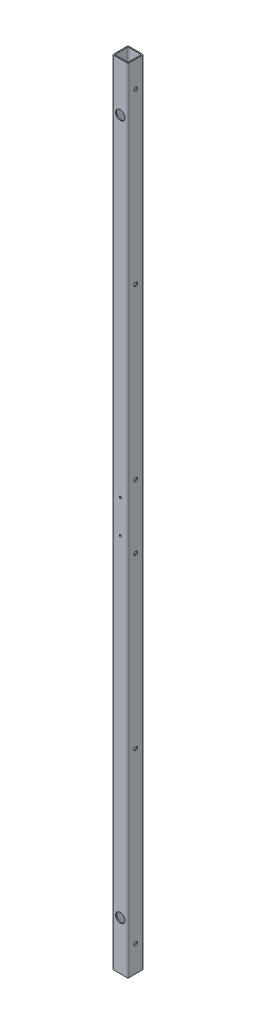
ISO-10303-21;
HEADER;
FILE_DESCRIPTION(('STEP AP214'),'2;1');
FILE_NAME('part.step','',(''),(''),'','','');
FILE_SCHEMA(('AUTOMOTIVE_DESIGN { 1 0 10303 214 1 1 1 1 }'));
ENDSEC;
DATA;
#1=APPLICATION_CONTEXT('core data for automotive mechanical design processes');
#2=APPLICATION_PROTOCOL_DEFINITION('international standard','automotive_design',2000,#1);
#3=PRODUCT_CONTEXT('',#1,'mechanical');
#4=PRODUCT('Part','Part','',(#3));
#5=PRODUCT_RELATED_PRODUCT_CATEGORY('part','',(#4));
#6=PRODUCT_DEFINITION_FORMATION('','',#4);
#7=PRODUCT_DEFINITION_CONTEXT('part definition',#1,'design');
#8=PRODUCT_DEFINITION('design','',#6,#7);
#9=PRODUCT_DEFINITION_SHAPE('','',#8);
#10=(LENGTH_UNIT() NAMED_UNIT(*) SI_UNIT(.MILLI.,.METRE.));
#11=(NAMED_UNIT(*) PLANE_ANGLE_UNIT() SI_UNIT($,.RADIAN.));
#12=(NAMED_UNIT(*) SI_UNIT($,.STERADIAN.) SOLID_ANGLE_UNIT());
#13=UNCERTAINTY_MEASURE_WITH_UNIT(LENGTH_MEASURE(1.E-05),#10,'distance_accuracy_value','');
#14=(GEOMETRIC_REPRESENTATION_CONTEXT(3) GLOBAL_UNCERTAINTY_ASSIGNED_CONTEXT((#13)) GLOBAL_UNIT_ASSIGNED_CONTEXT((#10,
#11,#12)) REPRESENTATION_CONTEXT('',''));
#15=CARTESIAN_POINT('',(0.,0.,0.));
#16=DIRECTION('',(0.,0.,1.));
#17=DIRECTION('',(1.,0.,0.));
#18=AXIS2_PLACEMENT_3D('',#15,#16,#17);
#19=CARTESIAN_POINT('',(-12.7,1309.624,-12.7));
#20=DIRECTION('',(0.,0.,1.));
#21=DIRECTION('',(1.,0.,0.));
#22=AXIS2_PLACEMENT_3D('',#19,#20,#21);
#23=PLANE('',#22);
#24=CARTESIAN_POINT('',(0.,1229.36,-12.7));
#25=DIRECTION('',(0.,0.,1.));
#26=DIRECTION('',(1.,0.,0.));
#27=AXIS2_PLACEMENT_3D('',#24,#25,#26);
#28=CIRCLE('',#27,7.739126);
#29=CARTESIAN_POINT('',(7.739126,1229.36,-12.7));
#30=VERTEX_POINT('',#29);
#31=EDGE_CURVE('E813',#30,#30,#28,.T.);
#32=ORIENTED_EDGE('',*,*,#31,.T.);
#33=EDGE_LOOP('',(#32));
#34=FACE_BOUND('',#33,.T.);
#35=CARTESIAN_POINT('',(0.,80.264,-12.7));
#36=DIRECTION('',(0.,0.,1.));
#37=DIRECTION('',(1.,0.,0.));
#38=AXIS2_PLACEMENT_3D('',#35,#36,#37);
#39=CIRCLE('',#38,7.739126);
#40=CARTESIAN_POINT('',(7.739126,80.264,-12.7));
#41=VERTEX_POINT('',#40);
#42=EDGE_CURVE('E279',#41,#41,#39,.T.);
#43=ORIENTED_EDGE('',*,*,#42,.T.);
#44=EDGE_LOOP('',(#43));
#45=FACE_BOUND('',#44,.T.);
#46=CARTESIAN_POINT('',(0.,627.38,-12.7));
#47=DIRECTION('',(0.,0.,-1.));
#48=DIRECTION('',(-1.,0.,0.));
#49=AXIS2_PLACEMENT_3D('',#46,#47,#48);
#50=CIRCLE('',#49,1.72719999999999);
#51=CARTESIAN_POINT('',(-1.72719999999999,627.38,-12.7));
#52=VERTEX_POINT('',#51);
#53=EDGE_CURVE('E306',#52,#52,#50,.T.);
#54=ORIENTED_EDGE('',*,*,#53,.F.);
#55=EDGE_LOOP('',(#54));
#56=FACE_BOUND('',#55,.T.);
#57=DIRECTION('',(-1.,0.,0.));
#58=VECTOR('',#57,1.);
#59=CARTESIAN_POINT('',(-12.7,0.,-12.7));
#60=LINE('',#59,#58);
#61=CARTESIAN_POINT('',(11.43,0.,-12.7));
#62=VERTEX_POINT('',#61);
#63=CARTESIAN_POINT('',(-11.43,0.,-12.7));
#64=VERTEX_POINT('',#63);
#65=EDGE_CURVE('E381',#62,#64,#60,.T.);
#66=ORIENTED_EDGE('',*,*,#65,.T.);
#67=DIRECTION('',(0.,-1.,0.));
#68=VECTOR('',#67,1.);
#69=CARTESIAN_POINT('',(-11.43,1309.624,-12.7));
#70=LINE('',#69,#68);
#71=CARTESIAN_POINT('',(-11.43,1309.624,-12.7));
#72=VERTEX_POINT('',#71);
#73=EDGE_CURVE('E51',#64,#72,#70,.F.);
#74=ORIENTED_EDGE('',*,*,#73,.T.);
#75=DIRECTION('',(-1.,0.,0.));
#76=VECTOR('',#75,1.);
#77=CARTESIAN_POINT('',(-12.7,1309.624,-12.7));
#78=LINE('',#77,#76);
#79=CARTESIAN_POINT('',(11.43,1309.624,-12.7));
#80=VERTEX_POINT('',#79);
#81=EDGE_CURVE('E375',#80,#72,#78,.T.);
#82=ORIENTED_EDGE('',*,*,#81,.F.);
#83=DIRECTION('',(0.,-1.,0.));
#84=VECTOR('',#83,1.);
#85=CARTESIAN_POINT('',(11.43,1309.624,-12.7));
#86=LINE('',#85,#84);
#87=EDGE_CURVE('E224',#80,#62,#86,.T.);
#88=ORIENTED_EDGE('',*,*,#87,.T.);
#89=EDGE_LOOP('',(#66,#74,#82,#88));
#90=FACE_BOUND('',#89,.T.);
#91=CARTESIAN_POINT('',(0.,682.244,-12.7));
#92=DIRECTION('',(0.,0.,-1.));
#93=DIRECTION('',(-1.,0.,0.));
#94=AXIS2_PLACEMENT_3D('',#91,#92,#93);
#95=CIRCLE('',#94,1.72719999999999);
#96=CARTESIAN_POINT('',(-1.72719999999999,682.244,-12.7));
#97=VERTEX_POINT('',#96);
#98=EDGE_CURVE('E283',#97,#97,#95,.T.);
#99=ORIENTED_EDGE('',*,*,#98,.F.);
#100=EDGE_LOOP('',(#99));
#101=FACE_BOUND('',#100,.T.);
#102=ADVANCED_FACE('F34',(#34,#45,#56,#90,#101),#23,.F.);
#103=CARTESIAN_POINT('',(0.,1309.624,0.));
#104=DIRECTION('',(0.,-1.,0.));
#105=DIRECTION('',(0.,0.,-1.));
#106=AXIS2_PLACEMENT_3D('',#103,#104,#105);
#107=PLANE('',#106);
#108=DIRECTION('',(0.,0.,1.));
#109=VECTOR('',#108,1.);
#110=CARTESIAN_POINT('',(-12.7,1309.624,12.7));
#111=LINE('',#110,#109);
#112=CARTESIAN_POINT('',(-12.7,1309.624,-11.43));
#113=VERTEX_POINT('',#112);
#114=CARTESIAN_POINT('',(-12.7,1309.624,11.43));
#115=VERTEX_POINT('',#114);
#116=EDGE_CURVE('E180',#113,#115,#111,.T.);
#117=ORIENTED_EDGE('',*,*,#116,.T.);
#118=CARTESIAN_POINT('',(-11.43,1309.624,11.43));
#119=DIRECTION('',(0.,-1.,0.));
#120=DIRECTION('',(0.,0.,-1.));
#121=AXIS2_PLACEMENT_3D('',#118,#119,#120);
#122=CIRCLE('',#121,1.27);
#123=CARTESIAN_POINT('',(-11.43,1309.624,12.7));
#124=VERTEX_POINT('',#123);
#125=EDGE_CURVE('E222',#115,#124,#122,.F.);
#126=ORIENTED_EDGE('',*,*,#125,.T.);
#127=DIRECTION('',(1.,0.,0.));
#128=VECTOR('',#127,1.);
#129=CARTESIAN_POINT('',(-12.7,1309.624,12.7));
#130=LINE('',#129,#128);
#131=CARTESIAN_POINT('',(11.43,1309.624,12.7));
#132=VERTEX_POINT('',#131);
#133=EDGE_CURVE('E175',#124,#132,#130,.T.);
#134=ORIENTED_EDGE('',*,*,#133,.T.);
#135=CARTESIAN_POINT('',(11.43,1309.624,11.43));
#136=DIRECTION('',(0.,-1.,0.));
#137=DIRECTION('',(0.,0.,-1.));
#138=AXIS2_PLACEMENT_3D('',#135,#136,#137);
#139=CIRCLE('',#138,1.27);
#140=CARTESIAN_POINT('',(12.7,1309.624,11.43));
#141=VERTEX_POINT('',#140);
#142=EDGE_CURVE('E217',#132,#141,#139,.F.);
#143=ORIENTED_EDGE('',*,*,#142,.T.);
#144=DIRECTION('',(0.,0.,-1.));
#145=VECTOR('',#144,1.);
#146=CARTESIAN_POINT('',(12.7,1309.624,12.7));
#147=LINE('',#146,#145);
#148=CARTESIAN_POINT('',(12.7,1309.624,-11.43));
#149=VERTEX_POINT('',#148);
#150=EDGE_CURVE('E373',#141,#149,#147,.T.);
#151=ORIENTED_EDGE('',*,*,#150,.T.);
#152=CARTESIAN_POINT('',(11.43,1309.624,-11.43));
#153=DIRECTION('',(0.,-1.,0.));
#154=DIRECTION('',(0.,0.,-1.));
#155=AXIS2_PLACEMENT_3D('',#152,#153,#154);
#156=CIRCLE('',#155,1.27);
#157=EDGE_CURVE('E58',#149,#80,#156,.F.);
#158=ORIENTED_EDGE('',*,*,#157,.T.);
#159=ORIENTED_EDGE('',*,*,#81,.T.);
#160=CARTESIAN_POINT('',(-11.43,1309.624,-11.43));
#161=DIRECTION('',(0.,-1.,0.));
#162=DIRECTION('',(0.,0.,-1.));
#163=AXIS2_PLACEMENT_3D('',#160,#161,#162);
#164=CIRCLE('',#163,1.27);
#165=EDGE_CURVE('E220',#72,#113,#164,.F.);
#166=ORIENTED_EDGE('',*,*,#165,.T.);
#167=EDGE_LOOP('',(#117,#126,#134,#143,#151,#158,#159,#166));
#168=FACE_BOUND('',#167,.T.);
#169=DIRECTION('',(1.,0.,0.));
#170=VECTOR('',#169,1.);
#171=CARTESIAN_POINT('',(-11.049,1309.624,11.049));
#172=LINE('',#171,#170);
#173=CARTESIAN_POINT('',(-9.779,1309.624,11.049));
#174=VERTEX_POINT('',#173);
#175=CARTESIAN_POINT('',(9.779,1309.624,11.049));
#176=VERTEX_POINT('',#175);
#177=EDGE_CURVE('E356',#174,#176,#172,.T.);
#178=ORIENTED_EDGE('',*,*,#177,.F.);
#179=CARTESIAN_POINT('',(-9.779,1309.624,9.779));
#180=DIRECTION('',(0.,-1.,0.));
#181=DIRECTION('',(0.,0.,-1.));
#182=AXIS2_PLACEMENT_3D('',#179,#180,#181);
#183=CIRCLE('',#182,1.27);
#184=CARTESIAN_POINT('',(-11.049,1309.624,9.779));
#185=VERTEX_POINT('',#184);
#186=EDGE_CURVE('E11',#174,#185,#183,.T.);
#187=ORIENTED_EDGE('',*,*,#186,.T.);
#188=DIRECTION('',(0.,0.,1.));
#189=VECTOR('',#188,1.);
#190=CARTESIAN_POINT('',(-11.049,1309.624,11.049));
#191=LINE('',#190,#189);
#192=CARTESIAN_POINT('',(-11.049,1309.624,-9.779));
#193=VERTEX_POINT('',#192);
#194=EDGE_CURVE('E364',#193,#185,#191,.T.);
#195=ORIENTED_EDGE('',*,*,#194,.F.);
#196=CARTESIAN_POINT('',(-9.779,1309.624,-9.779));
#197=DIRECTION('',(0.,-1.,0.));
#198=DIRECTION('',(0.,0.,-1.));
#199=AXIS2_PLACEMENT_3D('',#196,#197,#198);
#200=CIRCLE('',#199,1.27);
#201=CARTESIAN_POINT('',(-9.779,1309.624,-11.049));
#202=VERTEX_POINT('',#201);
#203=EDGE_CURVE('E235',#193,#202,#200,.T.);
#204=ORIENTED_EDGE('',*,*,#203,.T.);
#205=DIRECTION('',(-1.,0.,0.));
#206=VECTOR('',#205,1.);
#207=CARTESIAN_POINT('',(-11.049,1309.624,-11.049));
#208=LINE('',#207,#206);
#209=CARTESIAN_POINT('',(9.779,1309.624,-11.049));
#210=VERTEX_POINT('',#209);
#211=EDGE_CURVE('E362',#210,#202,#208,.T.);
#212=ORIENTED_EDGE('',*,*,#211,.F.);
#213=CARTESIAN_POINT('',(9.779,1309.624,-9.779));
#214=DIRECTION('',(0.,-1.,0.));
#215=DIRECTION('',(0.,0.,-1.));
#216=AXIS2_PLACEMENT_3D('',#213,#214,#215);
#217=CIRCLE('',#216,1.27);
#218=CARTESIAN_POINT('',(11.049,1309.624,-9.779));
#219=VERTEX_POINT('',#218);
#220=EDGE_CURVE('E160',#210,#219,#217,.T.);
#221=ORIENTED_EDGE('',*,*,#220,.T.);
#222=DIRECTION('',(0.,0.,-1.));
#223=VECTOR('',#222,1.);
#224=CARTESIAN_POINT('',(11.049,1309.624,11.049));
#225=LINE('',#224,#223);
#226=CARTESIAN_POINT('',(11.049,1309.624,9.779));
#227=VERTEX_POINT('',#226);
#228=EDGE_CURVE('E359',#227,#219,#225,.T.);
#229=ORIENTED_EDGE('',*,*,#228,.F.);
#230=CARTESIAN_POINT('',(9.779,1309.624,9.779));
#231=DIRECTION('',(0.,-1.,0.));
#232=DIRECTION('',(0.,0.,-1.));
#233=AXIS2_PLACEMENT_3D('',#230,#231,#232);
#234=CIRCLE('',#233,1.27);
#235=EDGE_CURVE('E161',#227,#176,#234,.T.);
#236=ORIENTED_EDGE('',*,*,#235,.T.);
#237=EDGE_LOOP('',(#178,#187,#195,#204,#212,#221,#229,#236));
#238=FACE_BOUND('',#237,.T.);
#239=ADVANCED_FACE('F399',(#168,#238),#107,.F.);
#240=CARTESIAN_POINT('',(0.,0.,0.));
#241=DIRECTION('',(0.,-1.,0.));
#242=DIRECTION('',(0.,0.,-1.));
#243=AXIS2_PLACEMENT_3D('',#240,#241,#242);
#244=PLANE('',#243);
#245=DIRECTION('',(1.,0.,0.));
#246=VECTOR('',#245,1.);
#247=CARTESIAN_POINT('',(-12.7,0.,12.7));
#248=LINE('',#247,#246);
#249=CARTESIAN_POINT('',(-11.43,0.,12.7));
#250=VERTEX_POINT('',#249);
#251=CARTESIAN_POINT('',(11.43,0.,12.7));
#252=VERTEX_POINT('',#251);
#253=EDGE_CURVE('E183',#250,#252,#248,.T.);
#254=ORIENTED_EDGE('',*,*,#253,.F.);
#255=CARTESIAN_POINT('',(-11.43,0.,11.43));
#256=DIRECTION('',(0.,-1.,0.));
#257=DIRECTION('',(0.,0.,-1.));
#258=AXIS2_PLACEMENT_3D('',#255,#256,#257);
#259=CIRCLE('',#258,1.27);
#260=CARTESIAN_POINT('',(-12.7,0.,11.43));
#261=VERTEX_POINT('',#260);
#262=EDGE_CURVE('E210',#250,#261,#259,.T.);
#263=ORIENTED_EDGE('',*,*,#262,.T.);
#264=DIRECTION('',(0.,0.,1.));
#265=VECTOR('',#264,1.);
#266=CARTESIAN_POINT('',(-12.7,0.,12.7));
#267=LINE('',#266,#265);
#268=CARTESIAN_POINT('',(-12.7,0.,-11.43));
#269=VERTEX_POINT('',#268);
#270=EDGE_CURVE('E382',#269,#261,#267,.T.);
#271=ORIENTED_EDGE('',*,*,#270,.F.);
#272=CARTESIAN_POINT('',(-11.43,0.,-11.43));
#273=DIRECTION('',(0.,-1.,0.));
#274=DIRECTION('',(0.,0.,-1.));
#275=AXIS2_PLACEMENT_3D('',#272,#273,#274);
#276=CIRCLE('',#275,1.27);
#277=EDGE_CURVE('E208',#269,#64,#276,.T.);
#278=ORIENTED_EDGE('',*,*,#277,.T.);
#279=ORIENTED_EDGE('',*,*,#65,.F.);
#280=CARTESIAN_POINT('',(11.43,0.,-11.43));
#281=DIRECTION('',(0.,-1.,0.));
#282=DIRECTION('',(0.,0.,-1.));
#283=AXIS2_PLACEMENT_3D('',#280,#281,#282);
#284=CIRCLE('',#283,1.27);
#285=CARTESIAN_POINT('',(12.7,0.,-11.43));
#286=VERTEX_POINT('',#285);
#287=EDGE_CURVE('E206',#62,#286,#284,.T.);
#288=ORIENTED_EDGE('',*,*,#287,.T.);
#289=DIRECTION('',(0.,0.,-1.));
#290=VECTOR('',#289,1.);
#291=CARTESIAN_POINT('',(12.7,0.,12.7));
#292=LINE('',#291,#290);
#293=CARTESIAN_POINT('',(12.7,0.,11.43));
#294=VERTEX_POINT('',#293);
#295=EDGE_CURVE('E367',#294,#286,#292,.T.);
#296=ORIENTED_EDGE('',*,*,#295,.F.);
#297=CARTESIAN_POINT('',(11.43,0.,11.43));
#298=DIRECTION('',(0.,-1.,0.));
#299=DIRECTION('',(0.,0.,-1.));
#300=AXIS2_PLACEMENT_3D('',#297,#298,#299);
#301=CIRCLE('',#300,1.27);
#302=EDGE_CURVE('E204',#294,#252,#301,.T.);
#303=ORIENTED_EDGE('',*,*,#302,.T.);
#304=EDGE_LOOP('',(#254,#263,#271,#278,#279,#288,#296,#303));
#305=FACE_BOUND('',#304,.T.);
#306=DIRECTION('',(-1.,0.,0.));
#307=VECTOR('',#306,1.);
#308=CARTESIAN_POINT('',(-11.049,0.,-11.049));
#309=LINE('',#308,#307);
#310=CARTESIAN_POINT('',(9.779,0.,-11.049));
#311=VERTEX_POINT('',#310);
#312=CARTESIAN_POINT('',(-9.779,0.,-11.049));
#313=VERTEX_POINT('',#312);
#314=EDGE_CURVE('E153',#311,#313,#309,.T.);
#315=ORIENTED_EDGE('',*,*,#314,.T.);
#316=CARTESIAN_POINT('',(-9.779,0.,-9.779));
#317=DIRECTION('',(0.,-1.,0.));
#318=DIRECTION('',(0.,0.,-1.));
#319=AXIS2_PLACEMENT_3D('',#316,#317,#318);
#320=CIRCLE('',#319,1.27);
#321=CARTESIAN_POINT('',(-11.049,0.,-9.779));
#322=VERTEX_POINT('',#321);
#323=EDGE_CURVE('E233',#313,#322,#320,.F.);
#324=ORIENTED_EDGE('',*,*,#323,.T.);
#325=DIRECTION('',(0.,0.,1.));
#326=VECTOR('',#325,1.);
#327=CARTESIAN_POINT('',(-11.049,0.,11.049));
#328=LINE('',#327,#326);
#329=CARTESIAN_POINT('',(-11.049,0.,9.779));
#330=VERTEX_POINT('',#329);
#331=EDGE_CURVE('E171',#322,#330,#328,.T.);
#332=ORIENTED_EDGE('',*,*,#331,.T.);
#333=CARTESIAN_POINT('',(-9.779,0.,9.779));
#334=DIRECTION('',(0.,-1.,0.));
#335=DIRECTION('',(0.,0.,-1.));
#336=AXIS2_PLACEMENT_3D('',#333,#334,#335);
#337=CIRCLE('',#336,1.27);
#338=CARTESIAN_POINT('',(-9.779,0.,11.049));
#339=VERTEX_POINT('',#338);
#340=EDGE_CURVE('E43',#330,#339,#337,.F.);
#341=ORIENTED_EDGE('',*,*,#340,.T.);
#342=DIRECTION('',(1.,0.,0.));
#343=VECTOR('',#342,1.);
#344=CARTESIAN_POINT('',(-11.049,0.,11.049));
#345=LINE('',#344,#343);
#346=CARTESIAN_POINT('',(9.779,0.,11.049));
#347=VERTEX_POINT('',#346);
#348=EDGE_CURVE('E355',#339,#347,#345,.T.);
#349=ORIENTED_EDGE('',*,*,#348,.T.);
#350=CARTESIAN_POINT('',(9.779,0.,9.779));
#351=DIRECTION('',(0.,-1.,0.));
#352=DIRECTION('',(0.,0.,-1.));
#353=AXIS2_PLACEMENT_3D('',#350,#351,#352);
#354=CIRCLE('',#353,1.27);
#355=CARTESIAN_POINT('',(11.049,0.,9.779));
#356=VERTEX_POINT('',#355);
#357=EDGE_CURVE('E237',#347,#356,#354,.F.);
#358=ORIENTED_EDGE('',*,*,#357,.T.);
#359=DIRECTION('',(0.,0.,-1.));
#360=VECTOR('',#359,1.);
#361=CARTESIAN_POINT('',(11.049,0.,11.049));
#362=LINE('',#361,#360);
#363=CARTESIAN_POINT('',(11.049,0.,-9.779));
#364=VERTEX_POINT('',#363);
#365=EDGE_CURVE('E155',#356,#364,#362,.T.);
#366=ORIENTED_EDGE('',*,*,#365,.T.);
#367=CARTESIAN_POINT('',(9.779,0.,-9.779));
#368=DIRECTION('',(0.,-1.,0.));
#369=DIRECTION('',(0.,0.,-1.));
#370=AXIS2_PLACEMENT_3D('',#367,#368,#369);
#371=CIRCLE('',#370,1.27);
#372=EDGE_CURVE('E150',#364,#311,#371,.F.);
#373=ORIENTED_EDGE('',*,*,#372,.T.);
#374=EDGE_LOOP('',(#315,#324,#332,#341,#349,#358,#366,#373));
#375=FACE_BOUND('',#374,.T.);
#376=ADVANCED_FACE('F152',(#305,#375),#244,.T.);
#377=CARTESIAN_POINT('',(12.7,1309.624,12.7));
#378=DIRECTION('',(-1.,0.,0.));
#379=DIRECTION('',(0.,0.,1.));
#380=AXIS2_PLACEMENT_3D('',#377,#378,#379);
#381=PLANE('',#380);
#382=CARTESIAN_POINT('',(12.7,1266.444,0.));
#383=DIRECTION('',(1.,0.,0.));
#384=DIRECTION('',(0.,0.,-1.));
#385=AXIS2_PLACEMENT_3D('',#382,#383,#384);
#386=CIRCLE('',#385,2.8956);
#387=CARTESIAN_POINT('',(12.7,1266.444,-2.89559999999992));
#388=VERTEX_POINT('',#387);
#389=EDGE_CURVE('E313',#388,#388,#386,.T.);
#390=ORIENTED_EDGE('',*,*,#389,.F.);
#391=EDGE_LOOP('',(#390));
#392=FACE_BOUND('',#391,.T.);
#393=CARTESIAN_POINT('',(12.7,987.044,0.));
#394=DIRECTION('',(1.,0.,0.));
#395=DIRECTION('',(0.,0.,-1.));
#396=AXIS2_PLACEMENT_3D('',#393,#394,#395);
#397=CIRCLE('',#396,2.8956);
#398=CARTESIAN_POINT('',(12.7,987.044,-2.89559999999992));
#399=VERTEX_POINT('',#398);
#400=EDGE_CURVE('E320',#399,#399,#397,.T.);
#401=ORIENTED_EDGE('',*,*,#400,.F.);
#402=EDGE_LOOP('',(#401));
#403=FACE_BOUND('',#402,.T.);
#404=CARTESIAN_POINT('',(12.7,707.644,0.));
#405=DIRECTION('',(1.,0.,0.));
#406=DIRECTION('',(0.,0.,-1.));
#407=AXIS2_PLACEMENT_3D('',#404,#405,#406);
#408=CIRCLE('',#407,2.8956);
#409=CARTESIAN_POINT('',(12.7,707.644,-2.89559999999992));
#410=VERTEX_POINT('',#409);
#411=EDGE_CURVE('E327',#410,#410,#408,.T.);
#412=ORIENTED_EDGE('',*,*,#411,.F.);
#413=EDGE_LOOP('',(#412));
#414=FACE_BOUND('',#413,.T.);
#415=CARTESIAN_POINT('',(12.7,43.18,-1.54390389361936E-13));
#416=DIRECTION('',(1.,0.,0.));
#417=DIRECTION('',(0.,0.,-1.));
#418=AXIS2_PLACEMENT_3D('',#415,#416,#417);
#419=CIRCLE('',#418,2.89559999999998);
#420=CARTESIAN_POINT('',(12.7,43.18,-2.89560000000014));
#421=VERTEX_POINT('',#420);
#422=EDGE_CURVE('E334',#421,#421,#419,.T.);
#423=ORIENTED_EDGE('',*,*,#422,.F.);
#424=EDGE_LOOP('',(#423));
#425=FACE_BOUND('',#424,.T.);
#426=CARTESIAN_POINT('',(12.7,322.58,-1.54390389361936E-13));
#427=DIRECTION('',(1.,0.,0.));
#428=DIRECTION('',(0.,0.,-1.));
#429=AXIS2_PLACEMENT_3D('',#426,#427,#428);
#430=CIRCLE('',#429,2.8956);
#431=CARTESIAN_POINT('',(12.7,322.58,-2.89560000000015));
#432=VERTEX_POINT('',#431);
#433=EDGE_CURVE('E341',#432,#432,#430,.T.);
#434=ORIENTED_EDGE('',*,*,#433,.F.);
#435=EDGE_LOOP('',(#434));
#436=FACE_BOUND('',#435,.T.);
#437=CARTESIAN_POINT('',(12.7,601.98,-1.54390389361936E-13));
#438=DIRECTION('',(1.,0.,0.));
#439=DIRECTION('',(0.,0.,-1.));
#440=AXIS2_PLACEMENT_3D('',#437,#438,#439);
#441=CIRCLE('',#440,2.8956);
#442=CARTESIAN_POINT('',(12.7,601.98,-2.89560000000015));
#443=VERTEX_POINT('',#442);
#444=EDGE_CURVE('E348',#443,#443,#441,.T.);
#445=ORIENTED_EDGE('',*,*,#444,.F.);
#446=EDGE_LOOP('',(#445));
#447=FACE_BOUND('',#446,.T.);
#448=ORIENTED_EDGE('',*,*,#295,.T.);
#449=DIRECTION('',(0.,-1.,0.));
#450=VECTOR('',#449,1.);
#451=CARTESIAN_POINT('',(12.7,1309.624,-11.43));
#452=LINE('',#451,#450);
#453=EDGE_CURVE('E231',#286,#149,#452,.F.);
#454=ORIENTED_EDGE('',*,*,#453,.T.);
#455=ORIENTED_EDGE('',*,*,#150,.F.);
#456=DIRECTION('',(0.,-1.,0.));
#457=VECTOR('',#456,1.);
#458=CARTESIAN_POINT('',(12.7,1309.624,11.43));
#459=LINE('',#458,#457);
#460=EDGE_CURVE('E228',#141,#294,#459,.T.);
#461=ORIENTED_EDGE('',*,*,#460,.T.);
#462=EDGE_LOOP('',(#448,#454,#455,#461));
#463=FACE_BOUND('',#462,.T.);
#464=ADVANCED_FACE('F402',(#392,#403,#414,#425,#436,#447,#463),#381,.F.);
#465=CARTESIAN_POINT('',(-12.7,1309.624,12.7));
#466=DIRECTION('',(1.,0.,0.));
#467=DIRECTION('',(0.,0.,-1.));
#468=AXIS2_PLACEMENT_3D('',#465,#466,#467);
#469=PLANE('',#468);
#470=CARTESIAN_POINT('',(-12.7,1266.444,0.));
#471=DIRECTION('',(1.,0.,0.));
#472=DIRECTION('',(0.,0.,-1.));
#473=AXIS2_PLACEMENT_3D('',#470,#471,#472);
#474=CIRCLE('',#473,2.8956);
#475=CARTESIAN_POINT('',(-12.7,1266.444,-2.89559999999992));
#476=VERTEX_POINT('',#475);
#477=EDGE_CURVE('E271',#476,#476,#474,.T.);
#478=ORIENTED_EDGE('',*,*,#477,.T.);
#479=EDGE_LOOP('',(#478));
#480=FACE_BOUND('',#479,.T.);
#481=CARTESIAN_POINT('',(-12.7,987.044,0.));
#482=DIRECTION('',(1.,0.,0.));
#483=DIRECTION('',(0.,0.,-1.));
#484=AXIS2_PLACEMENT_3D('',#481,#482,#483);
#485=CIRCLE('',#484,2.8956);
#486=CARTESIAN_POINT('',(-12.7,987.044,-2.89559999999992));
#487=VERTEX_POINT('',#486);
#488=EDGE_CURVE('E266',#487,#487,#485,.T.);
#489=ORIENTED_EDGE('',*,*,#488,.T.);
#490=EDGE_LOOP('',(#489));
#491=FACE_BOUND('',#490,.T.);
#492=CARTESIAN_POINT('',(-12.7,707.644,0.));
#493=DIRECTION('',(1.,0.,0.));
#494=DIRECTION('',(0.,0.,-1.));
#495=AXIS2_PLACEMENT_3D('',#492,#493,#494);
#496=CIRCLE('',#495,2.8956);
#497=CARTESIAN_POINT('',(-12.7,707.644,-2.89559999999992));
#498=VERTEX_POINT('',#497);
#499=EDGE_CURVE('E261',#498,#498,#496,.T.);
#500=ORIENTED_EDGE('',*,*,#499,.T.);
#501=EDGE_LOOP('',(#500));
#502=FACE_BOUND('',#501,.T.);
#503=CARTESIAN_POINT('',(-12.7,43.18,-1.54390389361936E-13));
#504=DIRECTION('',(1.,0.,0.));
#505=DIRECTION('',(0.,0.,-1.));
#506=AXIS2_PLACEMENT_3D('',#503,#504,#505);
#507=CIRCLE('',#506,2.8956);
#508=CARTESIAN_POINT('',(-12.7,43.18,-2.89560000000015));
#509=VERTEX_POINT('',#508);
#510=EDGE_CURVE('E256',#509,#509,#507,.T.);
#511=ORIENTED_EDGE('',*,*,#510,.T.);
#512=EDGE_LOOP('',(#511));
#513=FACE_BOUND('',#512,.T.);
#514=CARTESIAN_POINT('',(-12.7,322.58,-1.54390389361936E-13));
#515=DIRECTION('',(1.,0.,0.));
#516=DIRECTION('',(0.,0.,-1.));
#517=AXIS2_PLACEMENT_3D('',#514,#515,#516);
#518=CIRCLE('',#517,2.8956);
#519=CARTESIAN_POINT('',(-12.7,322.58,-2.89560000000015));
#520=VERTEX_POINT('',#519);
#521=EDGE_CURVE('E251',#520,#520,#518,.T.);
#522=ORIENTED_EDGE('',*,*,#521,.T.);
#523=EDGE_LOOP('',(#522));
#524=FACE_BOUND('',#523,.T.);
#525=CARTESIAN_POINT('',(-12.7,601.98,-1.54390389361936E-13));
#526=DIRECTION('',(1.,0.,0.));
#527=DIRECTION('',(0.,0.,-1.));
#528=AXIS2_PLACEMENT_3D('',#525,#526,#527);
#529=CIRCLE('',#528,2.8956);
#530=CARTESIAN_POINT('',(-12.7,601.98,-2.89560000000015));
#531=VERTEX_POINT('',#530);
#532=EDGE_CURVE('E246',#531,#531,#529,.T.);
#533=ORIENTED_EDGE('',*,*,#532,.T.);
#534=EDGE_LOOP('',(#533));
#535=FACE_BOUND('',#534,.T.);
#536=ORIENTED_EDGE('',*,*,#270,.T.);
#537=DIRECTION('',(0.,-1.,0.));
#538=VECTOR('',#537,1.);
#539=CARTESIAN_POINT('',(-12.7,1309.624,11.43));
#540=LINE('',#539,#538);
#541=EDGE_CURVE('E215',#261,#115,#540,.F.);
#542=ORIENTED_EDGE('',*,*,#541,.T.);
#543=ORIENTED_EDGE('',*,*,#116,.F.);
#544=DIRECTION('',(0.,-1.,0.));
#545=VECTOR('',#544,1.);
#546=CARTESIAN_POINT('',(-12.7,1309.624,-11.43));
#547=LINE('',#546,#545);
#548=EDGE_CURVE('E212',#113,#269,#547,.T.);
#549=ORIENTED_EDGE('',*,*,#548,.T.);
#550=EDGE_LOOP('',(#536,#542,#543,#549));
#551=FACE_BOUND('',#550,.T.);
#552=ADVANCED_FACE('F415',(#480,#491,#502,#513,#524,#535,#551),#469,.F.);
#553=CARTESIAN_POINT('',(-12.7,1309.624,12.7));
#554=DIRECTION('',(0.,0.,-1.));
#555=DIRECTION('',(-1.,0.,0.));
#556=AXIS2_PLACEMENT_3D('',#553,#554,#555);
#557=PLANE('',#556);
#558=CARTESIAN_POINT('',(0.,1229.36,12.7));
#559=DIRECTION('',(0.,0.,1.));
#560=DIRECTION('',(1.,0.,0.));
#561=AXIS2_PLACEMENT_3D('',#558,#559,#560);
#562=CIRCLE('',#561,7.739126);
#563=CARTESIAN_POINT('',(7.739126,1229.36,12.7));
#564=VERTEX_POINT('',#563);
#565=EDGE_CURVE('E812',#564,#564,#562,.T.);
#566=ORIENTED_EDGE('',*,*,#565,.F.);
#567=EDGE_LOOP('',(#566));
#568=FACE_BOUND('',#567,.T.);
#569=CARTESIAN_POINT('',(0.,80.264,12.7));
#570=DIRECTION('',(0.,0.,1.));
#571=DIRECTION('',(1.,0.,0.));
#572=AXIS2_PLACEMENT_3D('',#569,#570,#571);
#573=CIRCLE('',#572,7.739126);
#574=CARTESIAN_POINT('',(7.739126,80.264,12.7));
#575=VERTEX_POINT('',#574);
#576=EDGE_CURVE('E286',#575,#575,#573,.T.);
#577=ORIENTED_EDGE('',*,*,#576,.F.);
#578=EDGE_LOOP('',(#577));
#579=FACE_BOUND('',#578,.T.);
#580=CARTESIAN_POINT('',(0.,682.244,12.7));
#581=DIRECTION('',(0.,0.,-1.));
#582=DIRECTION('',(-1.,0.,0.));
#583=AXIS2_PLACEMENT_3D('',#580,#581,#582);
#584=CIRCLE('',#583,1.72719999999999);
#585=CARTESIAN_POINT('',(-1.72719999999999,682.244,12.7));
#586=VERTEX_POINT('',#585);
#587=EDGE_CURVE('E297',#586,#586,#584,.T.);
#588=ORIENTED_EDGE('',*,*,#587,.T.);
#589=EDGE_LOOP('',(#588));
#590=FACE_BOUND('',#589,.T.);
#591=CARTESIAN_POINT('',(0.,627.38,12.7));
#592=DIRECTION('',(0.,0.,-1.));
#593=DIRECTION('',(-1.,0.,0.));
#594=AXIS2_PLACEMENT_3D('',#591,#592,#593);
#595=CIRCLE('',#594,1.72719999999999);
#596=CARTESIAN_POINT('',(-1.7272,627.38,12.7));
#597=VERTEX_POINT('',#596);
#598=EDGE_CURVE('E275',#597,#597,#595,.T.);
#599=ORIENTED_EDGE('',*,*,#598,.T.);
#600=EDGE_LOOP('',(#599));
#601=FACE_BOUND('',#600,.T.);
#602=ORIENTED_EDGE('',*,*,#133,.F.);
#603=DIRECTION('',(0.,-1.,0.));
#604=VECTOR('',#603,1.);
#605=CARTESIAN_POINT('',(-11.43,1309.624,12.7));
#606=LINE('',#605,#604);
#607=EDGE_CURVE('E201',#124,#250,#606,.T.);
#608=ORIENTED_EDGE('',*,*,#607,.T.);
#609=ORIENTED_EDGE('',*,*,#253,.T.);
#610=DIRECTION('',(0.,-1.,0.));
#611=VECTOR('',#610,1.);
#612=CARTESIAN_POINT('',(11.43,1309.624,12.7));
#613=LINE('',#612,#611);
#614=EDGE_CURVE('E199',#252,#132,#613,.F.);
#615=ORIENTED_EDGE('',*,*,#614,.T.);
#616=EDGE_LOOP('',(#602,#608,#609,#615));
#617=FACE_BOUND('',#616,.T.);
#618=ADVANCED_FACE('F392',(#568,#579,#590,#601,#617),#557,.F.);
#619=CARTESIAN_POINT('',(-11.049,1309.624,11.049));
#620=DIRECTION('',(0.,0.,-1.));
#621=DIRECTION('',(-1.,0.,0.));
#622=AXIS2_PLACEMENT_3D('',#619,#620,#621);
#623=PLANE('',#622);
#624=CARTESIAN_POINT('',(0.,1229.36,11.049));
#625=DIRECTION('',(0.,0.,-1.));
#626=DIRECTION('',(-1.,0.,0.));
#627=AXIS2_PLACEMENT_3D('',#624,#625,#626);
#628=CIRCLE('',#627,7.739126);
#629=CARTESIAN_POINT('',(-7.739126,1229.36,11.049));
#630=VERTEX_POINT('',#629);
#631=EDGE_CURVE('E291',#630,#630,#628,.T.);
#632=ORIENTED_EDGE('',*,*,#631,.F.);
#633=EDGE_LOOP('',(#632));
#634=FACE_BOUND('',#633,.T.);
#635=CARTESIAN_POINT('',(0.,80.264,11.049));
#636=DIRECTION('',(0.,0.,-1.));
#637=DIRECTION('',(-1.,0.,0.));
#638=AXIS2_PLACEMENT_3D('',#635,#636,#637);
#639=CIRCLE('',#638,7.739126);
#640=CARTESIAN_POINT('',(-7.739126,80.264,11.049));
#641=VERTEX_POINT('',#640);
#642=EDGE_CURVE('E278',#641,#641,#639,.T.);
#643=ORIENTED_EDGE('',*,*,#642,.F.);
#644=EDGE_LOOP('',(#643));
#645=FACE_BOUND('',#644,.T.);
#646=CARTESIAN_POINT('',(0.,682.244,11.049));
#647=DIRECTION('',(0.,0.,-1.));
#648=DIRECTION('',(-1.,0.,0.));
#649=AXIS2_PLACEMENT_3D('',#646,#647,#648);
#650=CIRCLE('',#649,1.72719999999999);
#651=CARTESIAN_POINT('',(-1.72719999999999,682.244,11.049));
#652=VERTEX_POINT('',#651);
#653=EDGE_CURVE('E303',#652,#652,#650,.T.);
#654=ORIENTED_EDGE('',*,*,#653,.F.);
#655=EDGE_LOOP('',(#654));
#656=FACE_BOUND('',#655,.T.);
#657=CARTESIAN_POINT('',(0.,627.38,11.049));
#658=DIRECTION('',(0.,0.,-1.));
#659=DIRECTION('',(-1.,0.,0.));
#660=AXIS2_PLACEMENT_3D('',#657,#658,#659);
#661=CIRCLE('',#660,1.72719999999999);
#662=CARTESIAN_POINT('',(-1.72719999999999,627.38,11.049));
#663=VERTEX_POINT('',#662);
#664=EDGE_CURVE('E274',#663,#663,#661,.T.);
#665=ORIENTED_EDGE('',*,*,#664,.F.);
#666=EDGE_LOOP('',(#665));
#667=FACE_BOUND('',#666,.T.);
#668=ORIENTED_EDGE('',*,*,#177,.T.);
#669=DIRECTION('',(0.,-1.,0.));
#670=VECTOR('',#669,1.);
#671=CARTESIAN_POINT('',(9.779,0.,11.049));
#672=LINE('',#671,#670);
#673=EDGE_CURVE('E192',#176,#347,#672,.T.);
#674=ORIENTED_EDGE('',*,*,#673,.T.);
#675=ORIENTED_EDGE('',*,*,#348,.F.);
#676=DIRECTION('',(0.,-1.,0.));
#677=VECTOR('',#676,1.);
#678=CARTESIAN_POINT('',(-9.779,1309.624,11.049));
#679=LINE('',#678,#677);
#680=EDGE_CURVE('E190',#339,#174,#679,.F.);
#681=ORIENTED_EDGE('',*,*,#680,.T.);
#682=EDGE_LOOP('',(#668,#674,#675,#681));
#683=FACE_BOUND('',#682,.T.);
#684=ADVANCED_FACE('F601',(#634,#645,#656,#667,#683),#623,.T.);
#685=CARTESIAN_POINT('',(11.049,1309.624,11.049));
#686=DIRECTION('',(-1.,0.,0.));
#687=DIRECTION('',(0.,0.,1.));
#688=AXIS2_PLACEMENT_3D('',#685,#686,#687);
#689=PLANE('',#688);
#690=CARTESIAN_POINT('',(11.049,1266.444,0.));
#691=DIRECTION('',(-1.,0.,0.));
#692=DIRECTION('',(0.,0.,1.));
#693=AXIS2_PLACEMENT_3D('',#690,#691,#692);
#694=CIRCLE('',#693,2.8956);
#695=CARTESIAN_POINT('',(11.049,1266.444,2.89560000000007));
#696=VERTEX_POINT('',#695);
#697=EDGE_CURVE('E270',#696,#696,#694,.T.);
#698=ORIENTED_EDGE('',*,*,#697,.F.);
#699=EDGE_LOOP('',(#698));
#700=FACE_BOUND('',#699,.T.);
#701=CARTESIAN_POINT('',(11.049,987.044,0.));
#702=DIRECTION('',(-1.,0.,0.));
#703=DIRECTION('',(0.,0.,1.));
#704=AXIS2_PLACEMENT_3D('',#701,#702,#703);
#705=CIRCLE('',#704,2.8956);
#706=CARTESIAN_POINT('',(11.049,987.044,2.89560000000007));
#707=VERTEX_POINT('',#706);
#708=EDGE_CURVE('E265',#707,#707,#705,.T.);
#709=ORIENTED_EDGE('',*,*,#708,.F.);
#710=EDGE_LOOP('',(#709));
#711=FACE_BOUND('',#710,.T.);
#712=CARTESIAN_POINT('',(11.049,707.644,0.));
#713=DIRECTION('',(-1.,0.,0.));
#714=DIRECTION('',(0.,0.,1.));
#715=AXIS2_PLACEMENT_3D('',#712,#713,#714);
#716=CIRCLE('',#715,2.8956);
#717=CARTESIAN_POINT('',(11.049,707.644,2.89560000000007));
#718=VERTEX_POINT('',#717);
#719=EDGE_CURVE('E260',#718,#718,#716,.T.);
#720=ORIENTED_EDGE('',*,*,#719,.F.);
#721=EDGE_LOOP('',(#720));
#722=FACE_BOUND('',#721,.T.);
#723=CARTESIAN_POINT('',(11.049,43.18,-1.54390389361936E-13));
#724=DIRECTION('',(-1.,0.,0.));
#725=DIRECTION('',(0.,0.,1.));
#726=AXIS2_PLACEMENT_3D('',#723,#724,#725);
#727=CIRCLE('',#726,2.89559999999999);
#728=CARTESIAN_POINT('',(11.049,43.18,2.89559999999984));
#729=VERTEX_POINT('',#728);
#730=EDGE_CURVE('E252',#729,#729,#727,.T.);
#731=ORIENTED_EDGE('',*,*,#730,.F.);
#732=EDGE_LOOP('',(#731));
#733=FACE_BOUND('',#732,.T.);
#734=CARTESIAN_POINT('',(11.049,322.58,-1.54390389361936E-13));
#735=DIRECTION('',(-1.,0.,0.));
#736=DIRECTION('',(0.,0.,1.));
#737=AXIS2_PLACEMENT_3D('',#734,#735,#736);
#738=CIRCLE('',#737,2.8956);
#739=CARTESIAN_POINT('',(11.049,322.58,2.89559999999984));
#740=VERTEX_POINT('',#739);
#741=EDGE_CURVE('E250',#740,#740,#738,.T.);
#742=ORIENTED_EDGE('',*,*,#741,.F.);
#743=EDGE_LOOP('',(#742));
#744=FACE_BOUND('',#743,.T.);
#745=CARTESIAN_POINT('',(11.049,601.98,-1.54390389361936E-13));
#746=DIRECTION('',(-1.,0.,0.));
#747=DIRECTION('',(0.,0.,1.));
#748=AXIS2_PLACEMENT_3D('',#745,#746,#747);
#749=CIRCLE('',#748,2.8956);
#750=CARTESIAN_POINT('',(11.049,601.98,2.89559999999984));
#751=VERTEX_POINT('',#750);
#752=EDGE_CURVE('E245',#751,#751,#749,.T.);
#753=ORIENTED_EDGE('',*,*,#752,.F.);
#754=EDGE_LOOP('',(#753));
#755=FACE_BOUND('',#754,.T.);
#756=ORIENTED_EDGE('',*,*,#365,.F.);
#757=DIRECTION('',(0.,-1.,0.));
#758=VECTOR('',#757,1.);
#759=CARTESIAN_POINT('',(11.049,1309.624,9.779));
#760=LINE('',#759,#758);
#761=EDGE_CURVE('E197',#356,#227,#760,.F.);
#762=ORIENTED_EDGE('',*,*,#761,.T.);
#763=ORIENTED_EDGE('',*,*,#228,.T.);
#764=DIRECTION('',(0.,-1.,0.));
#765=VECTOR('',#764,1.);
#766=CARTESIAN_POINT('',(11.049,0.,-9.779));
#767=LINE('',#766,#765);
#768=EDGE_CURVE('E195',#219,#364,#767,.T.);
#769=ORIENTED_EDGE('',*,*,#768,.T.);
#770=EDGE_LOOP('',(#756,#762,#763,#769));
#771=FACE_BOUND('',#770,.T.);
#772=ADVANCED_FACE('F597',(#700,#711,#722,#733,#744,#755,#771),#689,.T.);
#773=CARTESIAN_POINT('',(-11.049,1309.624,-11.049));
#774=DIRECTION('',(0.,0.,1.));
#775=DIRECTION('',(1.,0.,0.));
#776=AXIS2_PLACEMENT_3D('',#773,#774,#775);
#777=PLANE('',#776);
#778=CARTESIAN_POINT('',(0.,1229.36,-11.049));
#779=DIRECTION('',(0.,0.,1.));
#780=DIRECTION('',(1.,0.,0.));
#781=AXIS2_PLACEMENT_3D('',#778,#779,#780);
#782=CIRCLE('',#781,7.739126);
#783=CARTESIAN_POINT('',(7.739126,1229.36,-11.049));
#784=VERTEX_POINT('',#783);
#785=EDGE_CURVE('E38',#784,#784,#782,.T.);
#786=ORIENTED_EDGE('',*,*,#785,.F.);
#787=EDGE_LOOP('',(#786));
#788=FACE_BOUND('',#787,.T.);
#789=CARTESIAN_POINT('',(0.,80.264,-11.049));
#790=DIRECTION('',(0.,0.,1.));
#791=DIRECTION('',(1.,0.,0.));
#792=AXIS2_PLACEMENT_3D('',#789,#790,#791);
#793=CIRCLE('',#792,7.739126);
#794=CARTESIAN_POINT('',(7.739126,80.264,-11.049));
#795=VERTEX_POINT('',#794);
#796=EDGE_CURVE('E276',#795,#795,#793,.T.);
#797=ORIENTED_EDGE('',*,*,#796,.F.);
#798=EDGE_LOOP('',(#797));
#799=FACE_BOUND('',#798,.T.);
#800=CARTESIAN_POINT('',(0.,682.244,-11.049));
#801=DIRECTION('',(0.,0.,1.));
#802=DIRECTION('',(1.,0.,0.));
#803=AXIS2_PLACEMENT_3D('',#800,#801,#802);
#804=CIRCLE('',#803,1.72719999999999);
#805=CARTESIAN_POINT('',(1.72719999999999,682.244,-11.049));
#806=VERTEX_POINT('',#805);
#807=EDGE_CURVE('E300',#806,#806,#804,.T.);
#808=ORIENTED_EDGE('',*,*,#807,.F.);
#809=EDGE_LOOP('',(#808));
#810=FACE_BOUND('',#809,.T.);
#811=CARTESIAN_POINT('',(0.,627.38,-11.049));
#812=DIRECTION('',(0.,0.,1.));
#813=DIRECTION('',(1.,0.,0.));
#814=AXIS2_PLACEMENT_3D('',#811,#812,#813);
#815=CIRCLE('',#814,1.72719999999999);
#816=CARTESIAN_POINT('',(1.72719999999999,627.38,-11.049));
#817=VERTEX_POINT('',#816);
#818=EDGE_CURVE('E272',#817,#817,#815,.T.);
#819=ORIENTED_EDGE('',*,*,#818,.F.);
#820=EDGE_LOOP('',(#819));
#821=FACE_BOUND('',#820,.T.);
#822=ORIENTED_EDGE('',*,*,#211,.T.);
#823=DIRECTION('',(0.,-1.,0.));
#824=VECTOR('',#823,1.);
#825=CARTESIAN_POINT('',(-9.779,0.,-11.049));
#826=LINE('',#825,#824);
#827=EDGE_CURVE('E170',#202,#313,#826,.T.);
#828=ORIENTED_EDGE('',*,*,#827,.T.);
#829=ORIENTED_EDGE('',*,*,#314,.F.);
#830=DIRECTION('',(0.,-1.,0.));
#831=VECTOR('',#830,1.);
#832=CARTESIAN_POINT('',(9.779,1309.624,-11.049));
#833=LINE('',#832,#831);
#834=EDGE_CURVE('E167',#311,#210,#833,.F.);
#835=ORIENTED_EDGE('',*,*,#834,.T.);
#836=EDGE_LOOP('',(#822,#828,#829,#835));
#837=FACE_BOUND('',#836,.T.);
#838=ADVANCED_FACE('F166',(#788,#799,#810,#821,#837),#777,.T.);
#839=CARTESIAN_POINT('',(-11.049,1309.624,11.049));
#840=DIRECTION('',(1.,0.,0.));
#841=DIRECTION('',(0.,0.,-1.));
#842=AXIS2_PLACEMENT_3D('',#839,#840,#841);
#843=PLANE('',#842);
#844=CARTESIAN_POINT('',(-11.049,1266.444,0.));
#845=DIRECTION('',(1.,0.,0.));
#846=DIRECTION('',(0.,0.,-1.));
#847=AXIS2_PLACEMENT_3D('',#844,#845,#846);
#848=CIRCLE('',#847,2.8956);
#849=CARTESIAN_POINT('',(-11.049,1266.444,-2.89559999999992));
#850=VERTEX_POINT('',#849);
#851=EDGE_CURVE('E267',#850,#850,#848,.T.);
#852=ORIENTED_EDGE('',*,*,#851,.F.);
#853=EDGE_LOOP('',(#852));
#854=FACE_BOUND('',#853,.T.);
#855=CARTESIAN_POINT('',(-11.049,987.044,0.));
#856=DIRECTION('',(1.,0.,0.));
#857=DIRECTION('',(0.,0.,-1.));
#858=AXIS2_PLACEMENT_3D('',#855,#856,#857);
#859=CIRCLE('',#858,2.8956);
#860=CARTESIAN_POINT('',(-11.049,987.044,-2.89559999999992));
#861=VERTEX_POINT('',#860);
#862=EDGE_CURVE('E262',#861,#861,#859,.T.);
#863=ORIENTED_EDGE('',*,*,#862,.F.);
#864=EDGE_LOOP('',(#863));
#865=FACE_BOUND('',#864,.T.);
#866=CARTESIAN_POINT('',(-11.049,707.644,0.));
#867=DIRECTION('',(1.,0.,0.));
#868=DIRECTION('',(0.,0.,-1.));
#869=AXIS2_PLACEMENT_3D('',#866,#867,#868);
#870=CIRCLE('',#869,2.8956);
#871=CARTESIAN_POINT('',(-11.049,707.644,-2.89559999999992));
#872=VERTEX_POINT('',#871);
#873=EDGE_CURVE('E257',#872,#872,#870,.T.);
#874=ORIENTED_EDGE('',*,*,#873,.F.);
#875=EDGE_LOOP('',(#874));
#876=FACE_BOUND('',#875,.T.);
#877=CARTESIAN_POINT('',(-11.049,43.18,-1.54390389361936E-13));
#878=DIRECTION('',(1.,0.,0.));
#879=DIRECTION('',(0.,0.,-1.));
#880=AXIS2_PLACEMENT_3D('',#877,#878,#879);
#881=CIRCLE('',#880,2.89559999999999);
#882=CARTESIAN_POINT('',(-11.049,43.18,-2.89560000000015));
#883=VERTEX_POINT('',#882);
#884=EDGE_CURVE('E255',#883,#883,#881,.T.);
#885=ORIENTED_EDGE('',*,*,#884,.F.);
#886=EDGE_LOOP('',(#885));
#887=FACE_BOUND('',#886,.T.);
#888=CARTESIAN_POINT('',(-11.049,322.58,-1.54390389361936E-13));
#889=DIRECTION('',(1.,0.,0.));
#890=DIRECTION('',(0.,0.,-1.));
#891=AXIS2_PLACEMENT_3D('',#888,#889,#890);
#892=CIRCLE('',#891,2.8956);
#893=CARTESIAN_POINT('',(-11.049,322.58,-2.89560000000015));
#894=VERTEX_POINT('',#893);
#895=EDGE_CURVE('E247',#894,#894,#892,.T.);
#896=ORIENTED_EDGE('',*,*,#895,.F.);
#897=EDGE_LOOP('',(#896));
#898=FACE_BOUND('',#897,.T.);
#899=CARTESIAN_POINT('',(-11.049,601.98,-1.54390389361936E-13));
#900=DIRECTION('',(1.,0.,0.));
#901=DIRECTION('',(0.,0.,-1.));
#902=AXIS2_PLACEMENT_3D('',#899,#900,#901);
#903=CIRCLE('',#902,2.8956);
#904=CARTESIAN_POINT('',(-11.049,601.98,-2.89560000000015));
#905=VERTEX_POINT('',#904);
#906=EDGE_CURVE('E242',#905,#905,#903,.T.);
#907=ORIENTED_EDGE('',*,*,#906,.F.);
#908=EDGE_LOOP('',(#907));
#909=FACE_BOUND('',#908,.T.);
#910=ORIENTED_EDGE('',*,*,#331,.F.);
#911=DIRECTION('',(0.,-1.,0.));
#912=VECTOR('',#911,1.);
#913=CARTESIAN_POINT('',(-11.049,1309.624,-9.779));
#914=LINE('',#913,#912);
#915=EDGE_CURVE('E188',#322,#193,#914,.F.);
#916=ORIENTED_EDGE('',*,*,#915,.T.);
#917=ORIENTED_EDGE('',*,*,#194,.T.);
#918=DIRECTION('',(0.,-1.,0.));
#919=VECTOR('',#918,1.);
#920=CARTESIAN_POINT('',(-11.049,0.,9.779));
#921=LINE('',#920,#919);
#922=EDGE_CURVE('E177',#185,#330,#921,.T.);
#923=ORIENTED_EDGE('',*,*,#922,.T.);
#924=EDGE_LOOP('',(#910,#916,#917,#923));
#925=FACE_BOUND('',#924,.T.);
#926=ADVANCED_FACE('F447',(#854,#865,#876,#887,#898,#909,#925),#843,.T.);
#927=CARTESIAN_POINT('',(-9.779,1309.624,-9.779));
#928=DIRECTION('',(0.,1.,0.));
#929=DIRECTION('',(0.,0.,1.));
#930=AXIS2_PLACEMENT_3D('',#927,#928,#929);
#931=CYLINDRICAL_SURFACE('',#930,1.27);
#932=ORIENTED_EDGE('',*,*,#203,.F.);
#933=ORIENTED_EDGE('',*,*,#915,.F.);
#934=ORIENTED_EDGE('',*,*,#323,.F.);
#935=ORIENTED_EDGE('',*,*,#827,.F.);
#936=EDGE_LOOP('',(#932,#933,#934,#935));
#937=FACE_BOUND('',#936,.T.);
#938=ADVANCED_FACE('F443',(#937),#931,.F.);
#939=CARTESIAN_POINT('',(9.779,1309.624,9.779));
#940=DIRECTION('',(0.,1.,0.));
#941=DIRECTION('',(0.,0.,1.));
#942=AXIS2_PLACEMENT_3D('',#939,#940,#941);
#943=CYLINDRICAL_SURFACE('',#942,1.27);
#944=ORIENTED_EDGE('',*,*,#235,.F.);
#945=ORIENTED_EDGE('',*,*,#761,.F.);
#946=ORIENTED_EDGE('',*,*,#357,.F.);
#947=ORIENTED_EDGE('',*,*,#673,.F.);
#948=EDGE_LOOP('',(#944,#945,#946,#947));
#949=FACE_BOUND('',#948,.T.);
#950=ADVANCED_FACE('F446',(#949),#943,.F.);
#951=CARTESIAN_POINT('',(9.779,1309.624,-9.779));
#952=DIRECTION('',(0.,1.,0.));
#953=DIRECTION('',(0.,0.,1.));
#954=AXIS2_PLACEMENT_3D('',#951,#952,#953);
#955=CYLINDRICAL_SURFACE('',#954,1.27);
#956=ORIENTED_EDGE('',*,*,#220,.F.);
#957=ORIENTED_EDGE('',*,*,#834,.F.);
#958=ORIENTED_EDGE('',*,*,#372,.F.);
#959=ORIENTED_EDGE('',*,*,#768,.F.);
#960=EDGE_LOOP('',(#956,#957,#958,#959));
#961=FACE_BOUND('',#960,.T.);
#962=ADVANCED_FACE('F174',(#961),#955,.F.);
#963=CARTESIAN_POINT('',(-9.779,1309.624,9.779));
#964=DIRECTION('',(0.,1.,0.));
#965=DIRECTION('',(0.,0.,1.));
#966=AXIS2_PLACEMENT_3D('',#963,#964,#965);
#967=CYLINDRICAL_SURFACE('',#966,1.27);
#968=ORIENTED_EDGE('',*,*,#186,.F.);
#969=ORIENTED_EDGE('',*,*,#680,.F.);
#970=ORIENTED_EDGE('',*,*,#340,.F.);
#971=ORIENTED_EDGE('',*,*,#922,.F.);
#972=EDGE_LOOP('',(#968,#969,#970,#971));
#973=FACE_BOUND('',#972,.T.);
#974=ADVANCED_FACE('F420',(#973),#967,.F.);
#975=CARTESIAN_POINT('',(-11.43,1309.624,11.43));
#976=DIRECTION('',(0.,-1.,0.));
#977=DIRECTION('',(0.,0.,-1.));
#978=AXIS2_PLACEMENT_3D('',#975,#976,#977);
#979=CYLINDRICAL_SURFACE('',#978,1.27);
#980=ORIENTED_EDGE('',*,*,#125,.F.);
#981=ORIENTED_EDGE('',*,*,#541,.F.);
#982=ORIENTED_EDGE('',*,*,#262,.F.);
#983=ORIENTED_EDGE('',*,*,#607,.F.);
#984=EDGE_LOOP('',(#980,#981,#982,#983));
#985=FACE_BOUND('',#984,.T.);
#986=ADVANCED_FACE('F418',(#985),#979,.T.);
#987=CARTESIAN_POINT('',(-11.43,1309.624,-11.43));
#988=DIRECTION('',(0.,-1.,0.));
#989=DIRECTION('',(0.,0.,-1.));
#990=AXIS2_PLACEMENT_3D('',#987,#988,#989);
#991=CYLINDRICAL_SURFACE('',#990,1.27);
#992=ORIENTED_EDGE('',*,*,#165,.F.);
#993=ORIENTED_EDGE('',*,*,#73,.F.);
#994=ORIENTED_EDGE('',*,*,#277,.F.);
#995=ORIENTED_EDGE('',*,*,#548,.F.);
#996=EDGE_LOOP('',(#992,#993,#994,#995));
#997=FACE_BOUND('',#996,.T.);
#998=ADVANCED_FACE('F413',(#997),#991,.T.);
#999=CARTESIAN_POINT('',(11.43,1309.624,-11.43));
#1000=DIRECTION('',(0.,-1.,0.));
#1001=DIRECTION('',(0.,0.,-1.));
#1002=AXIS2_PLACEMENT_3D('',#999,#1000,#1001);
#1003=CYLINDRICAL_SURFACE('',#1002,1.27);
#1004=ORIENTED_EDGE('',*,*,#157,.F.);
#1005=ORIENTED_EDGE('',*,*,#453,.F.);
#1006=ORIENTED_EDGE('',*,*,#287,.F.);
#1007=ORIENTED_EDGE('',*,*,#87,.F.);
#1008=EDGE_LOOP('',(#1004,#1005,#1006,#1007));
#1009=FACE_BOUND('',#1008,.T.);
#1010=ADVANCED_FACE('F406',(#1009),#1003,.T.);
#1011=CARTESIAN_POINT('',(11.43,1309.624,11.43));
#1012=DIRECTION('',(0.,-1.,0.));
#1013=DIRECTION('',(0.,0.,-1.));
#1014=AXIS2_PLACEMENT_3D('',#1011,#1012,#1013);
#1015=CYLINDRICAL_SURFACE('',#1014,1.27);
#1016=ORIENTED_EDGE('',*,*,#142,.F.);
#1017=ORIENTED_EDGE('',*,*,#614,.F.);
#1018=ORIENTED_EDGE('',*,*,#302,.F.);
#1019=ORIENTED_EDGE('',*,*,#460,.F.);
#1020=EDGE_LOOP('',(#1016,#1017,#1018,#1019));
#1021=FACE_BOUND('',#1020,.T.);
#1022=ADVANCED_FACE('F36',(#1021),#1015,.T.);
#1023=CARTESIAN_POINT('',(12.7,601.98,-1.54390389361936E-13));
#1024=DIRECTION('',(1.,0.,0.));
#1025=DIRECTION('',(0.,0.,-1.));
#1026=AXIS2_PLACEMENT_3D('',#1023,#1024,#1025);
#1027=CYLINDRICAL_SURFACE('',#1026,2.8956);
#1028=ORIENTED_EDGE('',*,*,#906,.T.);
#1029=EDGE_LOOP('',(#1028));
#1030=FACE_BOUND('',#1029,.T.);
#1031=ORIENTED_EDGE('',*,*,#532,.F.);
#1032=EDGE_LOOP('',(#1031));
#1033=FACE_BOUND('',#1032,.T.);
#1034=ADVANCED_FACE('F487',(#1030,#1033),#1027,.F.);
#1035=ORIENTED_EDGE('',*,*,#752,.T.);
#1036=EDGE_LOOP('',(#1035));
#1037=FACE_BOUND('',#1036,.T.);
#1038=ORIENTED_EDGE('',*,*,#444,.T.);
#1039=EDGE_LOOP('',(#1038));
#1040=FACE_BOUND('',#1039,.T.);
#1041=ADVANCED_FACE('F710',(#1037,#1040),#1027,.F.);
#1042=CARTESIAN_POINT('',(12.7,322.58,-1.54390389361936E-13));
#1043=DIRECTION('',(1.,0.,0.));
#1044=DIRECTION('',(0.,0.,-1.));
#1045=AXIS2_PLACEMENT_3D('',#1042,#1043,#1044);
#1046=CYLINDRICAL_SURFACE('',#1045,2.8956);
#1047=ORIENTED_EDGE('',*,*,#895,.T.);
#1048=EDGE_LOOP('',(#1047));
#1049=FACE_BOUND('',#1048,.T.);
#1050=ORIENTED_EDGE('',*,*,#521,.F.);
#1051=EDGE_LOOP('',(#1050));
#1052=FACE_BOUND('',#1051,.T.);
#1053=ADVANCED_FACE('F719',(#1049,#1052),#1046,.F.);
#1054=ORIENTED_EDGE('',*,*,#741,.T.);
#1055=EDGE_LOOP('',(#1054));
#1056=FACE_BOUND('',#1055,.T.);
#1057=ORIENTED_EDGE('',*,*,#433,.T.);
#1058=EDGE_LOOP('',(#1057));
#1059=FACE_BOUND('',#1058,.T.);
#1060=ADVANCED_FACE('F727',(#1056,#1059),#1046,.F.);
#1061=CARTESIAN_POINT('',(12.7,43.18,-1.54390389361936E-13));
#1062=DIRECTION('',(1.,0.,0.));
#1063=DIRECTION('',(0.,0.,-1.));
#1064=AXIS2_PLACEMENT_3D('',#1061,#1062,#1063);
#1065=CYLINDRICAL_SURFACE('',#1064,2.89559999999999);
#1066=ORIENTED_EDGE('',*,*,#884,.T.);
#1067=EDGE_LOOP('',(#1066));
#1068=FACE_BOUND('',#1067,.T.);
#1069=ORIENTED_EDGE('',*,*,#510,.F.);
#1070=EDGE_LOOP('',(#1069));
#1071=FACE_BOUND('',#1070,.T.);
#1072=ADVANCED_FACE('F736',(#1068,#1071),#1065,.F.);
#1073=ORIENTED_EDGE('',*,*,#730,.T.);
#1074=EDGE_LOOP('',(#1073));
#1075=FACE_BOUND('',#1074,.T.);
#1076=ORIENTED_EDGE('',*,*,#422,.T.);
#1077=EDGE_LOOP('',(#1076));
#1078=FACE_BOUND('',#1077,.T.);
#1079=ADVANCED_FACE('F514',(#1075,#1078),#1065,.F.);
#1080=CARTESIAN_POINT('',(12.7,707.644,0.));
#1081=DIRECTION('',(1.,0.,0.));
#1082=DIRECTION('',(0.,0.,-1.));
#1083=AXIS2_PLACEMENT_3D('',#1080,#1081,#1082);
#1084=CYLINDRICAL_SURFACE('',#1083,2.8956);
#1085=ORIENTED_EDGE('',*,*,#873,.T.);
#1086=EDGE_LOOP('',(#1085));
#1087=FACE_BOUND('',#1086,.T.);
#1088=ORIENTED_EDGE('',*,*,#499,.F.);
#1089=EDGE_LOOP('',(#1088));
#1090=FACE_BOUND('',#1089,.T.);
#1091=ADVANCED_FACE('F508',(#1087,#1090),#1084,.F.);
#1092=ORIENTED_EDGE('',*,*,#719,.T.);
#1093=EDGE_LOOP('',(#1092));
#1094=FACE_BOUND('',#1093,.T.);
#1095=ORIENTED_EDGE('',*,*,#411,.T.);
#1096=EDGE_LOOP('',(#1095));
#1097=FACE_BOUND('',#1096,.T.);
#1098=ADVANCED_FACE('F513',(#1094,#1097),#1084,.F.);
#1099=CARTESIAN_POINT('',(12.7,987.044,0.));
#1100=DIRECTION('',(1.,0.,0.));
#1101=DIRECTION('',(0.,0.,-1.));
#1102=AXIS2_PLACEMENT_3D('',#1099,#1100,#1101);
#1103=CYLINDRICAL_SURFACE('',#1102,2.8956);
#1104=ORIENTED_EDGE('',*,*,#862,.T.);
#1105=EDGE_LOOP('',(#1104));
#1106=FACE_BOUND('',#1105,.T.);
#1107=ORIENTED_EDGE('',*,*,#488,.F.);
#1108=EDGE_LOOP('',(#1107));
#1109=FACE_BOUND('',#1108,.T.);
#1110=ADVANCED_FACE('F526',(#1106,#1109),#1103,.F.);
#1111=ORIENTED_EDGE('',*,*,#708,.T.);
#1112=EDGE_LOOP('',(#1111));
#1113=FACE_BOUND('',#1112,.T.);
#1114=ORIENTED_EDGE('',*,*,#400,.T.);
#1115=EDGE_LOOP('',(#1114));
#1116=FACE_BOUND('',#1115,.T.);
#1117=ADVANCED_FACE('F535',(#1113,#1116),#1103,.F.);
#1118=CARTESIAN_POINT('',(12.7,1266.444,0.));
#1119=DIRECTION('',(1.,0.,0.));
#1120=DIRECTION('',(0.,0.,-1.));
#1121=AXIS2_PLACEMENT_3D('',#1118,#1119,#1120);
#1122=CYLINDRICAL_SURFACE('',#1121,2.8956);
#1123=ORIENTED_EDGE('',*,*,#851,.T.);
#1124=EDGE_LOOP('',(#1123));
#1125=FACE_BOUND('',#1124,.T.);
#1126=ORIENTED_EDGE('',*,*,#477,.F.);
#1127=EDGE_LOOP('',(#1126));
#1128=FACE_BOUND('',#1127,.T.);
#1129=ADVANCED_FACE('F545',(#1125,#1128),#1122,.F.);
#1130=ORIENTED_EDGE('',*,*,#697,.T.);
#1131=EDGE_LOOP('',(#1130));
#1132=FACE_BOUND('',#1131,.T.);
#1133=ORIENTED_EDGE('',*,*,#389,.T.);
#1134=EDGE_LOOP('',(#1133));
#1135=FACE_BOUND('',#1134,.T.);
#1136=ADVANCED_FACE('F554',(#1132,#1135),#1122,.F.);
#1137=CARTESIAN_POINT('',(0.,627.38,-12.7));
#1138=DIRECTION('',(0.,0.,-1.));
#1139=DIRECTION('',(-1.,0.,0.));
#1140=AXIS2_PLACEMENT_3D('',#1137,#1138,#1139);
#1141=CYLINDRICAL_SURFACE('',#1140,1.72719999999999);
#1142=ORIENTED_EDGE('',*,*,#818,.T.);
#1143=EDGE_LOOP('',(#1142));
#1144=FACE_BOUND('',#1143,.T.);
#1145=ORIENTED_EDGE('',*,*,#53,.T.);
#1146=EDGE_LOOP('',(#1145));
#1147=FACE_BOUND('',#1146,.T.);
#1148=ADVANCED_FACE('F564',(#1144,#1147),#1141,.F.);
#1149=ORIENTED_EDGE('',*,*,#664,.T.);
#1150=EDGE_LOOP('',(#1149));
#1151=FACE_BOUND('',#1150,.T.);
#1152=ORIENTED_EDGE('',*,*,#598,.F.);
#1153=EDGE_LOOP('',(#1152));
#1154=FACE_BOUND('',#1153,.T.);
#1155=ADVANCED_FACE('F614',(#1151,#1154),#1141,.F.);
#1156=CARTESIAN_POINT('',(0.,682.244,-12.7));
#1157=DIRECTION('',(0.,0.,-1.));
#1158=DIRECTION('',(-1.,0.,0.));
#1159=AXIS2_PLACEMENT_3D('',#1156,#1157,#1158);
#1160=CYLINDRICAL_SURFACE('',#1159,1.72719999999999);
#1161=ORIENTED_EDGE('',*,*,#653,.T.);
#1162=EDGE_LOOP('',(#1161));
#1163=FACE_BOUND('',#1162,.T.);
#1164=ORIENTED_EDGE('',*,*,#587,.F.);
#1165=EDGE_LOOP('',(#1164));
#1166=FACE_BOUND('',#1165,.T.);
#1167=ADVANCED_FACE('F608',(#1163,#1166),#1160,.F.);
#1168=ORIENTED_EDGE('',*,*,#807,.T.);
#1169=EDGE_LOOP('',(#1168));
#1170=FACE_BOUND('',#1169,.T.);
#1171=ORIENTED_EDGE('',*,*,#98,.T.);
#1172=EDGE_LOOP('',(#1171));
#1173=FACE_BOUND('',#1172,.T.);
#1174=ADVANCED_FACE('F613',(#1170,#1173),#1160,.F.);
#1175=CARTESIAN_POINT('',(0.,80.264,12.7));
#1176=DIRECTION('',(0.,0.,1.));
#1177=DIRECTION('',(1.,0.,0.));
#1178=AXIS2_PLACEMENT_3D('',#1175,#1176,#1177);
#1179=CYLINDRICAL_SURFACE('',#1178,7.739126);
#1180=ORIENTED_EDGE('',*,*,#796,.T.);
#1181=EDGE_LOOP('',(#1180));
#1182=FACE_BOUND('',#1181,.T.);
#1183=ORIENTED_EDGE('',*,*,#42,.F.);
#1184=EDGE_LOOP('',(#1183));
#1185=FACE_BOUND('',#1184,.T.);
#1186=ADVANCED_FACE('F626',(#1182,#1185),#1179,.F.);
#1187=ORIENTED_EDGE('',*,*,#642,.T.);
#1188=EDGE_LOOP('',(#1187));
#1189=FACE_BOUND('',#1188,.T.);
#1190=ORIENTED_EDGE('',*,*,#576,.T.);
#1191=EDGE_LOOP('',(#1190));
#1192=FACE_BOUND('',#1191,.T.);
#1193=ADVANCED_FACE('F777',(#1189,#1192),#1179,.F.);
#1194=CARTESIAN_POINT('',(0.,1229.36,12.7));
#1195=DIRECTION('',(0.,0.,1.));
#1196=DIRECTION('',(1.,0.,0.));
#1197=AXIS2_PLACEMENT_3D('',#1194,#1195,#1196);
#1198=CYLINDRICAL_SURFACE('',#1197,7.739126);
#1199=ORIENTED_EDGE('',*,*,#785,.T.);
#1200=EDGE_LOOP('',(#1199));
#1201=FACE_BOUND('',#1200,.T.);
#1202=ORIENTED_EDGE('',*,*,#31,.F.);
#1203=EDGE_LOOP('',(#1202));
#1204=FACE_BOUND('',#1203,.T.);
#1205=ADVANCED_FACE('F785',(#1201,#1204),#1198,.F.);
#1206=ORIENTED_EDGE('',*,*,#631,.T.);
#1207=EDGE_LOOP('',(#1206));
#1208=FACE_BOUND('',#1207,.T.);
#1209=ORIENTED_EDGE('',*,*,#565,.T.);
#1210=EDGE_LOOP('',(#1209));
#1211=FACE_BOUND('',#1210,.T.);
#1212=ADVANCED_FACE('F793',(#1208,#1211),#1198,.F.);
#1213=CLOSED_SHELL('',(#102,#239,#376,#464,#552,#618,#684,#772,#838,#926,#938,#950,#962,#974,
#986,#998,#1010,#1022,#1034,#1041,#1053,#1060,#1072,#1079,#1091,#1098,#1110,#1117,#1129,#1136,
#1148,#1155,#1167,#1174,#1186,#1193,#1205,#1212));
#1214=MANIFOLD_SOLID_BREP('B2',#1213);
#1215=ADVANCED_BREP_SHAPE_REPRESENTATION('',(#18,#1214),#14);
#1216=SHAPE_DEFINITION_REPRESENTATION(#9,#1215);
ENDSEC;
END-ISO-10303-21;
